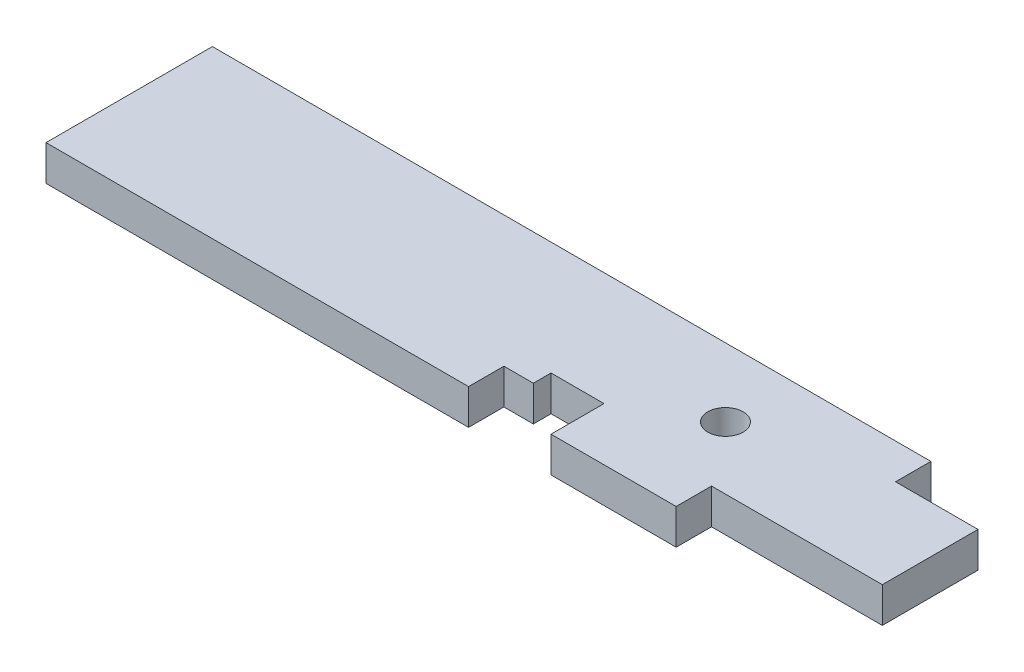
ISO-10303-21;
HEADER;
FILE_DESCRIPTION(('STEP AP214'),'2;1');
FILE_NAME('part.step','',(''),(''),'','','');
FILE_SCHEMA(('AUTOMOTIVE_DESIGN { 1 0 10303 214 1 1 1 1 }'));
ENDSEC;
DATA;
#1=APPLICATION_CONTEXT('core data for automotive mechanical design processes');
#2=APPLICATION_PROTOCOL_DEFINITION('international standard','automotive_design',2000,#1);
#3=PRODUCT_CONTEXT('',#1,'mechanical');
#4=PRODUCT('Part','Part','',(#3));
#5=PRODUCT_RELATED_PRODUCT_CATEGORY('part','',(#4));
#6=PRODUCT_DEFINITION_FORMATION('','',#4);
#7=PRODUCT_DEFINITION_CONTEXT('part definition',#1,'design');
#8=PRODUCT_DEFINITION('design','',#6,#7);
#9=PRODUCT_DEFINITION_SHAPE('','',#8);
#10=(LENGTH_UNIT() NAMED_UNIT(*) SI_UNIT(.MILLI.,.METRE.));
#11=(NAMED_UNIT(*) PLANE_ANGLE_UNIT() SI_UNIT($,.RADIAN.));
#12=(NAMED_UNIT(*) SI_UNIT($,.STERADIAN.) SOLID_ANGLE_UNIT());
#13=UNCERTAINTY_MEASURE_WITH_UNIT(LENGTH_MEASURE(1.E-05),#10,'distance_accuracy_value','');
#14=(GEOMETRIC_REPRESENTATION_CONTEXT(3) GLOBAL_UNCERTAINTY_ASSIGNED_CONTEXT((#13)) GLOBAL_UNIT_ASSIGNED_CONTEXT((#10,
#11,#12)) REPRESENTATION_CONTEXT('',''));
#15=CARTESIAN_POINT('',(0.,0.,0.));
#16=DIRECTION('',(0.,0.,1.));
#17=DIRECTION('',(1.,0.,0.));
#18=AXIS2_PLACEMENT_3D('',#15,#16,#17);
#19=CARTESIAN_POINT('',(0.,38.1,179.3875));
#20=DIRECTION('',(0.,0.,-1.));
#21=DIRECTION('',(-1.,0.,0.));
#22=AXIS2_PLACEMENT_3D('',#19,#20,#21);
#23=PLANE('',#22);
#24=DIRECTION('',(1.,0.,0.));
#25=VECTOR('',#24,1.);
#26=CARTESIAN_POINT('',(0.,0.,179.3875));
#27=LINE('',#26,#25);
#28=CARTESIAN_POINT('',(0.,0.,179.3875));
#29=VERTEX_POINT('',#28);
#30=CARTESIAN_POINT('',(455.6125,0.,179.3875));
#31=VERTEX_POINT('',#30);
#32=EDGE_CURVE('E163',#29,#31,#27,.T.);
#33=ORIENTED_EDGE('',*,*,#32,.T.);
#34=DIRECTION('',(0.,1.,0.));
#35=VECTOR('',#34,1.);
#36=CARTESIAN_POINT('',(455.6125,0.,179.3875));
#37=LINE('',#36,#35);
#38=CARTESIAN_POINT('',(455.6125,38.1,179.3875));
#39=VERTEX_POINT('',#38);
#40=EDGE_CURVE('E231',#31,#39,#37,.T.);
#41=ORIENTED_EDGE('',*,*,#40,.T.);
#42=DIRECTION('',(1.,0.,0.));
#43=VECTOR('',#42,1.);
#44=CARTESIAN_POINT('',(0.,38.1,179.3875));
#45=LINE('',#44,#43);
#46=CARTESIAN_POINT('',(0.,38.1,179.3875));
#47=VERTEX_POINT('',#46);
#48=EDGE_CURVE('E220',#47,#39,#45,.T.);
#49=ORIENTED_EDGE('',*,*,#48,.F.);
#50=DIRECTION('',(0.,-1.,0.));
#51=VECTOR('',#50,1.);
#52=CARTESIAN_POINT('',(0.,38.1,179.3875));
#53=LINE('',#52,#51);
#54=EDGE_CURVE('E11',#47,#29,#53,.T.);
#55=ORIENTED_EDGE('',*,*,#54,.T.);
#56=EDGE_LOOP('',(#33,#41,#49,#55));
#57=FACE_BOUND('',#56,.T.);
#58=ADVANCED_FACE('F40',(#57),#23,.F.);
#59=CARTESIAN_POINT('',(0.,38.1,0.));
#60=DIRECTION('',(0.,1.,0.));
#61=DIRECTION('',(0.,0.,1.));
#62=AXIS2_PLACEMENT_3D('',#59,#60,#61);
#63=PLANE('',#62);
#64=DIRECTION('',(0.,0.,1.));
#65=VECTOR('',#64,1.);
#66=CARTESIAN_POINT('',(679.45,38.1,179.3875));
#67=LINE('',#66,#65);
#68=CARTESIAN_POINT('',(679.45,38.1,141.2748));
#69=VERTEX_POINT('',#68);
#70=CARTESIAN_POINT('',(679.45,38.1,179.3875));
#71=VERTEX_POINT('',#70);
#72=EDGE_CURVE('E146',#69,#71,#67,.T.);
#73=ORIENTED_EDGE('',*,*,#72,.F.);
#74=DIRECTION('',(-1.,0.,0.));
#75=VECTOR('',#74,1.);
#76=CARTESIAN_POINT('',(679.45,38.1,141.2748));
#77=LINE('',#76,#75);
#78=CARTESIAN_POINT('',(863.6,38.1,141.2748));
#79=VERTEX_POINT('',#78);
#80=EDGE_CURVE('E159',#79,#69,#77,.T.);
#81=ORIENTED_EDGE('',*,*,#80,.F.);
#82=DIRECTION('',(0.,0.,-1.));
#83=VECTOR('',#82,1.);
#84=CARTESIAN_POINT('',(863.6,38.1,38.1));
#85=LINE('',#84,#83);
#86=CARTESIAN_POINT('',(863.6,38.1,38.1));
#87=VERTEX_POINT('',#86);
#88=EDGE_CURVE('E218',#79,#87,#85,.T.);
#89=ORIENTED_EDGE('',*,*,#88,.T.);
#90=DIRECTION('',(-1.,0.,0.));
#91=VECTOR('',#90,1.);
#92=CARTESIAN_POINT('',(774.7,38.1,38.1));
#93=LINE('',#92,#91);
#94=CARTESIAN_POINT('',(774.7,38.1,38.1));
#95=VERTEX_POINT('',#94);
#96=EDGE_CURVE('E197',#87,#95,#93,.T.);
#97=ORIENTED_EDGE('',*,*,#96,.T.);
#98=DIRECTION('',(0.,0.,-1.));
#99=VECTOR('',#98,1.);
#100=CARTESIAN_POINT('',(774.7,38.1,0.));
#101=LINE('',#100,#99);
#102=CARTESIAN_POINT('',(774.7,38.1,0.));
#103=VERTEX_POINT('',#102);
#104=EDGE_CURVE('E214',#95,#103,#101,.T.);
#105=ORIENTED_EDGE('',*,*,#104,.T.);
#106=DIRECTION('',(-1.,0.,0.));
#107=VECTOR('',#106,1.);
#108=CARTESIAN_POINT('',(0.,38.1,0.));
#109=LINE('',#108,#107);
#110=CARTESIAN_POINT('',(0.,38.1,0.));
#111=VERTEX_POINT('',#110);
#112=EDGE_CURVE('E185',#103,#111,#109,.T.);
#113=ORIENTED_EDGE('',*,*,#112,.T.);
#114=DIRECTION('',(0.,0.,1.));
#115=VECTOR('',#114,1.);
#116=CARTESIAN_POINT('',(0.,38.1,0.));
#117=LINE('',#116,#115);
#118=EDGE_CURVE('E180',#111,#47,#117,.T.);
#119=ORIENTED_EDGE('',*,*,#118,.T.);
#120=ORIENTED_EDGE('',*,*,#48,.T.);
#121=DIRECTION('',(0.,0.,1.));
#122=VECTOR('',#121,1.);
#123=CARTESIAN_POINT('',(455.6125,38.1,141.2875));
#124=LINE('',#123,#122);
#125=CARTESIAN_POINT('',(455.6125,38.1,141.2875));
#126=VERTEX_POINT('',#125);
#127=EDGE_CURVE('E256',#126,#39,#124,.T.);
#128=ORIENTED_EDGE('',*,*,#127,.F.);
#129=DIRECTION('',(-1.,0.,0.));
#130=VECTOR('',#129,1.);
#131=CARTESIAN_POINT('',(455.6125,38.1,141.2875));
#132=LINE('',#131,#130);
#133=CARTESIAN_POINT('',(487.3625,38.1,141.2875));
#134=VERTEX_POINT('',#133);
#135=EDGE_CURVE('E243',#134,#126,#132,.T.);
#136=ORIENTED_EDGE('',*,*,#135,.F.);
#137=DIRECTION('',(0.,0.,1.));
#138=VECTOR('',#137,1.);
#139=CARTESIAN_POINT('',(487.3625,38.1,141.2875));
#140=LINE('',#139,#138);
#141=CARTESIAN_POINT('',(487.3625,38.1,122.2375));
#142=VERTEX_POINT('',#141);
#143=EDGE_CURVE('E247',#142,#134,#140,.T.);
#144=ORIENTED_EDGE('',*,*,#143,.F.);
#145=DIRECTION('',(-1.,0.,0.));
#146=VECTOR('',#145,1.);
#147=CARTESIAN_POINT('',(544.5125,38.1,122.2375));
#148=LINE('',#147,#146);
#149=CARTESIAN_POINT('',(544.5125,38.1,122.2375));
#150=VERTEX_POINT('',#149);
#151=EDGE_CURVE('E250',#150,#142,#148,.T.);
#152=ORIENTED_EDGE('',*,*,#151,.F.);
#153=DIRECTION('',(0.,0.,-1.));
#154=VECTOR('',#153,1.);
#155=CARTESIAN_POINT('',(544.5125,38.1,179.3875));
#156=LINE('',#155,#154);
#157=CARTESIAN_POINT('',(544.5125,38.1,179.3875));
#158=VERTEX_POINT('',#157);
#159=EDGE_CURVE('E253',#158,#150,#156,.T.);
#160=ORIENTED_EDGE('',*,*,#159,.F.);
#161=EDGE_CURVE('E223',#158,#71,#45,.T.);
#162=ORIENTED_EDGE('',*,*,#161,.T.);
#163=EDGE_LOOP('',(#73,#81,#89,#97,#105,#113,#119,#120,#128,#136,#144,#152,#160,#162));
#164=FACE_BOUND('',#163,.T.);
#165=CARTESIAN_POINT('',(627.126,38.1,73.914));
#166=DIRECTION('',(0.,1.,0.));
#167=DIRECTION('',(0.,0.,1.));
#168=AXIS2_PLACEMENT_3D('',#165,#166,#167);
#169=CIRCLE('',#168,19.05);
#170=CARTESIAN_POINT('',(627.126,38.1,92.964));
#171=VERTEX_POINT('',#170);
#172=EDGE_CURVE('E169',#171,#171,#169,.T.);
#173=ORIENTED_EDGE('',*,*,#172,.F.);
#174=EDGE_LOOP('',(#173));
#175=FACE_BOUND('',#174,.T.);
#176=ADVANCED_FACE('F277',(#164,#175),#63,.T.);
#177=CARTESIAN_POINT('',(0.,0.,0.));
#178=DIRECTION('',(0.,1.,0.));
#179=DIRECTION('',(0.,0.,1.));
#180=AXIS2_PLACEMENT_3D('',#177,#178,#179);
#181=PLANE('',#180);
#182=DIRECTION('',(-1.,0.,0.));
#183=VECTOR('',#182,1.);
#184=CARTESIAN_POINT('',(679.45,0.,141.2748));
#185=LINE('',#184,#183);
#186=CARTESIAN_POINT('',(863.6,0.,141.2748));
#187=VERTEX_POINT('',#186);
#188=CARTESIAN_POINT('',(679.45,0.,141.2748));
#189=VERTEX_POINT('',#188);
#190=EDGE_CURVE('E55',#187,#189,#185,.T.);
#191=ORIENTED_EDGE('',*,*,#190,.T.);
#192=DIRECTION('',(0.,0.,1.));
#193=VECTOR('',#192,1.);
#194=CARTESIAN_POINT('',(679.45,0.,179.3875));
#195=LINE('',#194,#193);
#196=CARTESIAN_POINT('',(679.45,0.,179.3875));
#197=VERTEX_POINT('',#196);
#198=EDGE_CURVE('E144',#189,#197,#195,.T.);
#199=ORIENTED_EDGE('',*,*,#198,.T.);
#200=CARTESIAN_POINT('',(544.5125,0.,179.3875));
#201=VERTEX_POINT('',#200);
#202=EDGE_CURVE('E157',#201,#197,#27,.T.);
#203=ORIENTED_EDGE('',*,*,#202,.F.);
#204=DIRECTION('',(0.,0.,-1.));
#205=VECTOR('',#204,1.);
#206=CARTESIAN_POINT('',(544.5125,0.,179.3875));
#207=LINE('',#206,#205);
#208=CARTESIAN_POINT('',(544.5125,0.,122.2375));
#209=VERTEX_POINT('',#208);
#210=EDGE_CURVE('E63',#201,#209,#207,.T.);
#211=ORIENTED_EDGE('',*,*,#210,.T.);
#212=DIRECTION('',(-1.,0.,0.));
#213=VECTOR('',#212,1.);
#214=CARTESIAN_POINT('',(544.5125,0.,122.2375));
#215=LINE('',#214,#213);
#216=CARTESIAN_POINT('',(487.3625,0.,122.2375));
#217=VERTEX_POINT('',#216);
#218=EDGE_CURVE('E264',#209,#217,#215,.T.);
#219=ORIENTED_EDGE('',*,*,#218,.T.);
#220=DIRECTION('',(0.,0.,1.));
#221=VECTOR('',#220,1.);
#222=CARTESIAN_POINT('',(487.3625,0.,141.2875));
#223=LINE('',#222,#221);
#224=CARTESIAN_POINT('',(487.3625,0.,141.2875));
#225=VERTEX_POINT('',#224);
#226=EDGE_CURVE('E261',#217,#225,#223,.T.);
#227=ORIENTED_EDGE('',*,*,#226,.T.);
#228=DIRECTION('',(-1.,0.,0.));
#229=VECTOR('',#228,1.);
#230=CARTESIAN_POINT('',(455.6125,0.,141.2875));
#231=LINE('',#230,#229);
#232=CARTESIAN_POINT('',(455.6125,0.,141.2875));
#233=VERTEX_POINT('',#232);
#234=EDGE_CURVE('E234',#225,#233,#231,.T.);
#235=ORIENTED_EDGE('',*,*,#234,.T.);
#236=DIRECTION('',(0.,0.,1.));
#237=VECTOR('',#236,1.);
#238=CARTESIAN_POINT('',(455.6125,0.,141.2875));
#239=LINE('',#238,#237);
#240=EDGE_CURVE('E246',#233,#31,#239,.T.);
#241=ORIENTED_EDGE('',*,*,#240,.T.);
#242=ORIENTED_EDGE('',*,*,#32,.F.);
#243=DIRECTION('',(0.,0.,1.));
#244=VECTOR('',#243,1.);
#245=CARTESIAN_POINT('',(0.,0.,0.));
#246=LINE('',#245,#244);
#247=CARTESIAN_POINT('',(0.,0.,0.));
#248=VERTEX_POINT('',#247);
#249=EDGE_CURVE('E164',#248,#29,#246,.T.);
#250=ORIENTED_EDGE('',*,*,#249,.F.);
#251=DIRECTION('',(-1.,0.,0.));
#252=VECTOR('',#251,1.);
#253=CARTESIAN_POINT('',(0.,0.,0.));
#254=LINE('',#253,#252);
#255=CARTESIAN_POINT('',(774.7,0.,0.));
#256=VERTEX_POINT('',#255);
#257=EDGE_CURVE('E178',#256,#248,#254,.T.);
#258=ORIENTED_EDGE('',*,*,#257,.F.);
#259=DIRECTION('',(0.,0.,-1.));
#260=VECTOR('',#259,1.);
#261=CARTESIAN_POINT('',(774.7,0.,0.));
#262=LINE('',#261,#260);
#263=CARTESIAN_POINT('',(774.7,0.,38.1));
#264=VERTEX_POINT('',#263);
#265=EDGE_CURVE('E176',#264,#256,#262,.T.);
#266=ORIENTED_EDGE('',*,*,#265,.F.);
#267=DIRECTION('',(-1.,0.,0.));
#268=VECTOR('',#267,1.);
#269=CARTESIAN_POINT('',(774.7,0.,38.1));
#270=LINE('',#269,#268);
#271=CARTESIAN_POINT('',(863.6,0.,38.1));
#272=VERTEX_POINT('',#271);
#273=EDGE_CURVE('E174',#272,#264,#270,.T.);
#274=ORIENTED_EDGE('',*,*,#273,.F.);
#275=DIRECTION('',(0.,0.,-1.));
#276=VECTOR('',#275,1.);
#277=CARTESIAN_POINT('',(863.6,0.,38.1));
#278=LINE('',#277,#276);
#279=EDGE_CURVE('E167',#187,#272,#278,.T.);
#280=ORIENTED_EDGE('',*,*,#279,.F.);
#281=EDGE_LOOP('',(#191,#199,#203,#211,#219,#227,#235,#241,#242,#250,#258,#266,#274,#280));
#282=FACE_BOUND('',#281,.T.);
#283=CARTESIAN_POINT('',(627.126,0.,73.914));
#284=DIRECTION('',(0.,1.,0.));
#285=DIRECTION('',(0.,0.,1.));
#286=AXIS2_PLACEMENT_3D('',#283,#284,#285);
#287=CIRCLE('',#286,19.05);
#288=CARTESIAN_POINT('',(627.126,0.,92.964));
#289=VERTEX_POINT('',#288);
#290=EDGE_CURVE('E225',#289,#289,#287,.T.);
#291=ORIENTED_EDGE('',*,*,#290,.T.);
#292=EDGE_LOOP('',(#291));
#293=FACE_BOUND('',#292,.T.);
#294=ADVANCED_FACE('F155',(#282,#293),#181,.F.);
#295=CARTESIAN_POINT('',(0.,38.1,0.));
#296=DIRECTION('',(1.,0.,0.));
#297=DIRECTION('',(0.,0.,-1.));
#298=AXIS2_PLACEMENT_3D('',#295,#296,#297);
#299=PLANE('',#298);
#300=ORIENTED_EDGE('',*,*,#249,.T.);
#301=ORIENTED_EDGE('',*,*,#54,.F.);
#302=ORIENTED_EDGE('',*,*,#118,.F.);
#303=DIRECTION('',(0.,-1.,0.));
#304=VECTOR('',#303,1.);
#305=CARTESIAN_POINT('',(0.,38.1,0.));
#306=LINE('',#305,#304);
#307=EDGE_CURVE('E181',#111,#248,#306,.T.);
#308=ORIENTED_EDGE('',*,*,#307,.T.);
#309=EDGE_LOOP('',(#300,#301,#302,#308));
#310=FACE_BOUND('',#309,.T.);
#311=ADVANCED_FACE('F42',(#310),#299,.F.);
#312=ORIENTED_EDGE('',*,*,#202,.T.);
#313=DIRECTION('',(0.,1.,0.));
#314=VECTOR('',#313,1.);
#315=CARTESIAN_POINT('',(679.45,0.,179.3875));
#316=LINE('',#315,#314);
#317=EDGE_CURVE('E141',#197,#71,#316,.T.);
#318=ORIENTED_EDGE('',*,*,#317,.T.);
#319=ORIENTED_EDGE('',*,*,#161,.F.);
#320=DIRECTION('',(0.,1.,0.));
#321=VECTOR('',#320,1.);
#322=CARTESIAN_POINT('',(544.5125,0.,179.3875));
#323=LINE('',#322,#321);
#324=EDGE_CURVE('E162',#201,#158,#323,.T.);
#325=ORIENTED_EDGE('',*,*,#324,.F.);
#326=EDGE_LOOP('',(#312,#318,#319,#325));
#327=FACE_BOUND('',#326,.T.);
#328=ADVANCED_FACE('F161',(#327),#23,.F.);
#329=CARTESIAN_POINT('',(863.6,38.1,38.1));
#330=DIRECTION('',(-1.,0.,0.));
#331=DIRECTION('',(0.,0.,1.));
#332=AXIS2_PLACEMENT_3D('',#329,#330,#331);
#333=PLANE('',#332);
#334=ORIENTED_EDGE('',*,*,#88,.F.);
#335=DIRECTION('',(0.,1.,0.));
#336=VECTOR('',#335,1.);
#337=CARTESIAN_POINT('',(863.6,0.,141.2748));
#338=LINE('',#337,#336);
#339=EDGE_CURVE('E151',#187,#79,#338,.T.);
#340=ORIENTED_EDGE('',*,*,#339,.F.);
#341=ORIENTED_EDGE('',*,*,#279,.T.);
#342=DIRECTION('',(0.,-1.,0.));
#343=VECTOR('',#342,1.);
#344=CARTESIAN_POINT('',(863.6,38.1,38.1));
#345=LINE('',#344,#343);
#346=EDGE_CURVE('E48',#87,#272,#345,.T.);
#347=ORIENTED_EDGE('',*,*,#346,.F.);
#348=EDGE_LOOP('',(#334,#340,#341,#347));
#349=FACE_BOUND('',#348,.T.);
#350=ADVANCED_FACE('F305',(#349),#333,.F.);
#351=CARTESIAN_POINT('',(774.7,38.1,38.1));
#352=DIRECTION('',(0.,0.,1.));
#353=DIRECTION('',(1.,0.,0.));
#354=AXIS2_PLACEMENT_3D('',#351,#352,#353);
#355=PLANE('',#354);
#356=ORIENTED_EDGE('',*,*,#273,.T.);
#357=DIRECTION('',(0.,-1.,0.));
#358=VECTOR('',#357,1.);
#359=CARTESIAN_POINT('',(774.7,38.1,38.1));
#360=LINE('',#359,#358);
#361=EDGE_CURVE('E188',#95,#264,#360,.T.);
#362=ORIENTED_EDGE('',*,*,#361,.F.);
#363=ORIENTED_EDGE('',*,*,#96,.F.);
#364=ORIENTED_EDGE('',*,*,#346,.T.);
#365=EDGE_LOOP('',(#356,#362,#363,#364));
#366=FACE_BOUND('',#365,.T.);
#367=ADVANCED_FACE('F195',(#366),#355,.F.);
#368=CARTESIAN_POINT('',(774.7,38.1,0.));
#369=DIRECTION('',(-1.,0.,0.));
#370=DIRECTION('',(0.,0.,1.));
#371=AXIS2_PLACEMENT_3D('',#368,#369,#370);
#372=PLANE('',#371);
#373=ORIENTED_EDGE('',*,*,#265,.T.);
#374=DIRECTION('',(0.,-1.,0.));
#375=VECTOR('',#374,1.);
#376=CARTESIAN_POINT('',(774.7,38.1,0.));
#377=LINE('',#376,#375);
#378=EDGE_CURVE('E184',#103,#256,#377,.T.);
#379=ORIENTED_EDGE('',*,*,#378,.F.);
#380=ORIENTED_EDGE('',*,*,#104,.F.);
#381=ORIENTED_EDGE('',*,*,#361,.T.);
#382=EDGE_LOOP('',(#373,#379,#380,#381));
#383=FACE_BOUND('',#382,.T.);
#384=ADVANCED_FACE('F205',(#383),#372,.F.);
#385=CARTESIAN_POINT('',(0.,38.1,0.));
#386=DIRECTION('',(0.,0.,1.));
#387=DIRECTION('',(1.,0.,0.));
#388=AXIS2_PLACEMENT_3D('',#385,#386,#387);
#389=PLANE('',#388);
#390=ORIENTED_EDGE('',*,*,#257,.T.);
#391=ORIENTED_EDGE('',*,*,#307,.F.);
#392=ORIENTED_EDGE('',*,*,#112,.F.);
#393=ORIENTED_EDGE('',*,*,#378,.T.);
#394=EDGE_LOOP('',(#390,#391,#392,#393));
#395=FACE_BOUND('',#394,.T.);
#396=ADVANCED_FACE('F209',(#395),#389,.F.);
#397=CARTESIAN_POINT('',(627.126,38.1,73.914));
#398=DIRECTION('',(0.,-1.,0.));
#399=DIRECTION('',(0.,0.,-1.));
#400=AXIS2_PLACEMENT_3D('',#397,#398,#399);
#401=CYLINDRICAL_SURFACE('',#400,19.05);
#402=ORIENTED_EDGE('',*,*,#172,.T.);
#403=EDGE_LOOP('',(#402));
#404=FACE_BOUND('',#403,.T.);
#405=ORIENTED_EDGE('',*,*,#290,.F.);
#406=EDGE_LOOP('',(#405));
#407=FACE_BOUND('',#406,.T.);
#408=ADVANCED_FACE('F322',(#404,#407),#401,.F.);
#409=CARTESIAN_POINT('',(455.6125,0.,141.2875));
#410=DIRECTION('',(-1.,0.,0.));
#411=DIRECTION('',(0.,0.,1.));
#412=AXIS2_PLACEMENT_3D('',#409,#410,#411);
#413=PLANE('',#412);
#414=ORIENTED_EDGE('',*,*,#127,.T.);
#415=ORIENTED_EDGE('',*,*,#40,.F.);
#416=ORIENTED_EDGE('',*,*,#240,.F.);
#417=DIRECTION('',(0.,1.,0.));
#418=VECTOR('',#417,1.);
#419=CARTESIAN_POINT('',(455.6125,0.,141.2875));
#420=LINE('',#419,#418);
#421=EDGE_CURVE('E228',#233,#126,#420,.T.);
#422=ORIENTED_EDGE('',*,*,#421,.T.);
#423=EDGE_LOOP('',(#414,#415,#416,#422));
#424=FACE_BOUND('',#423,.T.);
#425=ADVANCED_FACE('F296',(#424),#413,.F.);
#426=CARTESIAN_POINT('',(455.6125,0.,141.2875));
#427=DIRECTION('',(0.,0.,-1.));
#428=DIRECTION('',(-1.,0.,0.));
#429=AXIS2_PLACEMENT_3D('',#426,#427,#428);
#430=PLANE('',#429);
#431=ORIENTED_EDGE('',*,*,#135,.T.);
#432=ORIENTED_EDGE('',*,*,#421,.F.);
#433=ORIENTED_EDGE('',*,*,#234,.F.);
#434=DIRECTION('',(0.,1.,0.));
#435=VECTOR('',#434,1.);
#436=CARTESIAN_POINT('',(487.3625,0.,141.2875));
#437=LINE('',#436,#435);
#438=EDGE_CURVE('E240',#225,#134,#437,.T.);
#439=ORIENTED_EDGE('',*,*,#438,.T.);
#440=EDGE_LOOP('',(#431,#432,#433,#439));
#441=FACE_BOUND('',#440,.T.);
#442=ADVANCED_FACE('F292',(#441),#430,.F.);
#443=CARTESIAN_POINT('',(487.3625,0.,141.2875));
#444=DIRECTION('',(-1.,0.,0.));
#445=DIRECTION('',(0.,0.,1.));
#446=AXIS2_PLACEMENT_3D('',#443,#444,#445);
#447=PLANE('',#446);
#448=ORIENTED_EDGE('',*,*,#143,.T.);
#449=ORIENTED_EDGE('',*,*,#438,.F.);
#450=ORIENTED_EDGE('',*,*,#226,.F.);
#451=DIRECTION('',(0.,1.,0.));
#452=VECTOR('',#451,1.);
#453=CARTESIAN_POINT('',(487.3625,0.,122.2375));
#454=LINE('',#453,#452);
#455=EDGE_CURVE('E238',#217,#142,#454,.T.);
#456=ORIENTED_EDGE('',*,*,#455,.T.);
#457=EDGE_LOOP('',(#448,#449,#450,#456));
#458=FACE_BOUND('',#457,.T.);
#459=ADVANCED_FACE('F289',(#458),#447,.F.);
#460=CARTESIAN_POINT('',(544.5125,0.,122.2375));
#461=DIRECTION('',(0.,0.,-1.));
#462=DIRECTION('',(-1.,0.,0.));
#463=AXIS2_PLACEMENT_3D('',#460,#461,#462);
#464=PLANE('',#463);
#465=ORIENTED_EDGE('',*,*,#151,.T.);
#466=ORIENTED_EDGE('',*,*,#455,.F.);
#467=ORIENTED_EDGE('',*,*,#218,.F.);
#468=DIRECTION('',(0.,1.,0.));
#469=VECTOR('',#468,1.);
#470=CARTESIAN_POINT('',(544.5125,0.,122.2375));
#471=LINE('',#470,#469);
#472=EDGE_CURVE('E236',#209,#150,#471,.T.);
#473=ORIENTED_EDGE('',*,*,#472,.T.);
#474=EDGE_LOOP('',(#465,#466,#467,#473));
#475=FACE_BOUND('',#474,.T.);
#476=ADVANCED_FACE('F285',(#475),#464,.F.);
#477=CARTESIAN_POINT('',(544.5125,0.,179.3875));
#478=DIRECTION('',(1.,0.,0.));
#479=DIRECTION('',(0.,0.,-1.));
#480=AXIS2_PLACEMENT_3D('',#477,#478,#479);
#481=PLANE('',#480);
#482=ORIENTED_EDGE('',*,*,#159,.T.);
#483=ORIENTED_EDGE('',*,*,#472,.F.);
#484=ORIENTED_EDGE('',*,*,#210,.F.);
#485=ORIENTED_EDGE('',*,*,#324,.T.);
#486=EDGE_LOOP('',(#482,#483,#484,#485));
#487=FACE_BOUND('',#486,.T.);
#488=ADVANCED_FACE('F282',(#487),#481,.F.);
#489=CARTESIAN_POINT('',(679.45,0.,179.3875));
#490=DIRECTION('',(-1.,0.,0.));
#491=DIRECTION('',(0.,0.,1.));
#492=AXIS2_PLACEMENT_3D('',#489,#490,#491);
#493=PLANE('',#492);
#494=ORIENTED_EDGE('',*,*,#72,.T.);
#495=ORIENTED_EDGE('',*,*,#317,.F.);
#496=ORIENTED_EDGE('',*,*,#198,.F.);
#497=DIRECTION('',(0.,1.,0.));
#498=VECTOR('',#497,1.);
#499=CARTESIAN_POINT('',(679.45,0.,141.2748));
#500=LINE('',#499,#498);
#501=EDGE_CURVE('E258',#189,#69,#500,.T.);
#502=ORIENTED_EDGE('',*,*,#501,.T.);
#503=EDGE_LOOP('',(#494,#495,#496,#502));
#504=FACE_BOUND('',#503,.T.);
#505=ADVANCED_FACE('F143',(#504),#493,.F.);
#506=CARTESIAN_POINT('',(679.45,0.,141.2748));
#507=DIRECTION('',(0.,0.,-1.));
#508=DIRECTION('',(-1.,0.,0.));
#509=AXIS2_PLACEMENT_3D('',#506,#507,#508);
#510=PLANE('',#509);
#511=ORIENTED_EDGE('',*,*,#80,.T.);
#512=ORIENTED_EDGE('',*,*,#501,.F.);
#513=ORIENTED_EDGE('',*,*,#190,.F.);
#514=ORIENTED_EDGE('',*,*,#339,.T.);
#515=EDGE_LOOP('',(#511,#512,#513,#514));
#516=FACE_BOUND('',#515,.T.);
#517=ADVANCED_FACE('F276',(#516),#510,.F.);
#518=CLOSED_SHELL('',(#58,#176,#294,#311,#328,#350,#367,#384,#396,#408,#425,#442,#459,#476,#488,
#505,#517));
#519=MANIFOLD_SOLID_BREP('B2',#518);
#520=ADVANCED_BREP_SHAPE_REPRESENTATION('',(#18,#519),#14);
#521=SHAPE_DEFINITION_REPRESENTATION(#9,#520);
ENDSEC;
END-ISO-10303-21;
